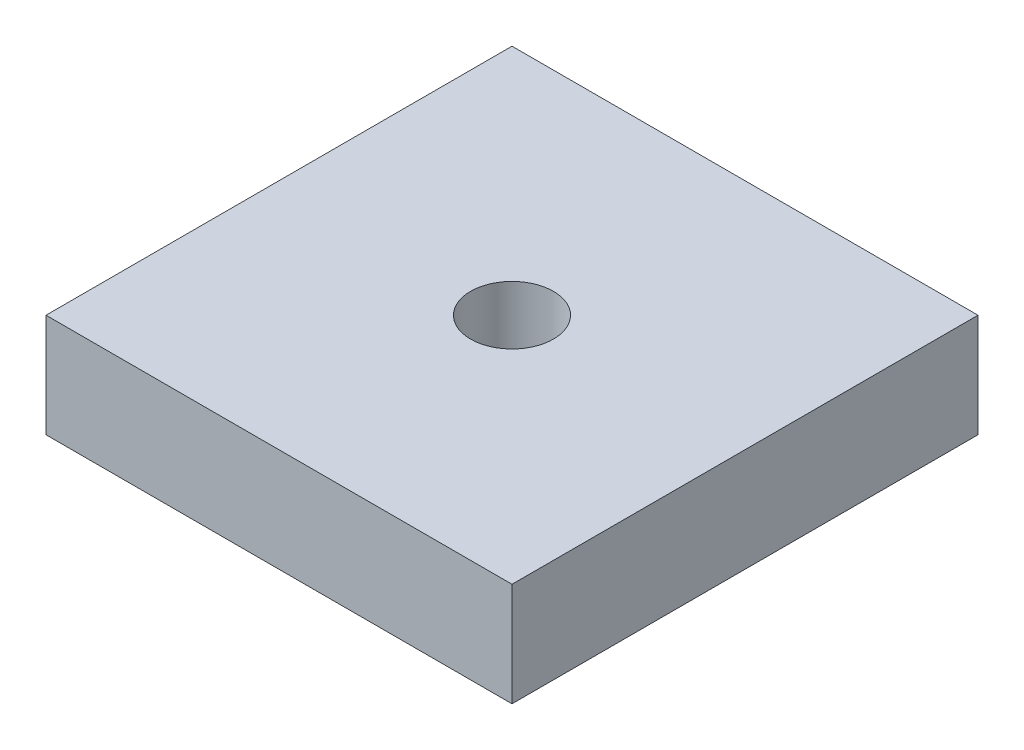
ISO-10303-21;
HEADER;
FILE_DESCRIPTION(('STEP AP214'),'2;1');
FILE_NAME('part.step','',(''),(''),'','','');
FILE_SCHEMA(('AUTOMOTIVE_DESIGN { 1 0 10303 214 1 1 1 1 }'));
ENDSEC;
DATA;
#1=APPLICATION_CONTEXT('core data for automotive mechanical design processes');
#2=APPLICATION_PROTOCOL_DEFINITION('international standard','automotive_design',2000,#1);
#3=PRODUCT_CONTEXT('',#1,'mechanical');
#4=PRODUCT('Part','Part','',(#3));
#5=PRODUCT_RELATED_PRODUCT_CATEGORY('part','',(#4));
#6=PRODUCT_DEFINITION_FORMATION('','',#4);
#7=PRODUCT_DEFINITION_CONTEXT('part definition',#1,'design');
#8=PRODUCT_DEFINITION('design','',#6,#7);
#9=PRODUCT_DEFINITION_SHAPE('','',#8);
#10=(LENGTH_UNIT() NAMED_UNIT(*) SI_UNIT(.MILLI.,.METRE.));
#11=(NAMED_UNIT(*) PLANE_ANGLE_UNIT() SI_UNIT($,.RADIAN.));
#12=(NAMED_UNIT(*) SI_UNIT($,.STERADIAN.) SOLID_ANGLE_UNIT());
#13=UNCERTAINTY_MEASURE_WITH_UNIT(LENGTH_MEASURE(1.E-05),#10,'distance_accuracy_value','');
#14=(GEOMETRIC_REPRESENTATION_CONTEXT(3) GLOBAL_UNCERTAINTY_ASSIGNED_CONTEXT((#13)) GLOBAL_UNIT_ASSIGNED_CONTEXT((#10,
#11,#12)) REPRESENTATION_CONTEXT('',''));
#15=CARTESIAN_POINT('',(0.,0.,0.));
#16=DIRECTION('',(0.,0.,1.));
#17=DIRECTION('',(1.,0.,0.));
#18=AXIS2_PLACEMENT_3D('',#15,#16,#17);
#19=CARTESIAN_POINT('',(-9.,2.,-9.));
#20=DIRECTION('',(1.,0.,0.));
#21=DIRECTION('',(0.,0.,-1.));
#22=AXIS2_PLACEMENT_3D('',#19,#20,#21);
#23=PLANE('',#22);
#24=DIRECTION('',(0.,0.,1.));
#25=VECTOR('',#24,1.);
#26=CARTESIAN_POINT('',(-9.,-2.,-9.));
#27=LINE('',#26,#25);
#28=CARTESIAN_POINT('',(-9.,-2.,-9.));
#29=VERTEX_POINT('',#28);
#30=CARTESIAN_POINT('',(-9.,-2.,9.));
#31=VERTEX_POINT('',#30);
#32=EDGE_CURVE('E79',#29,#31,#27,.T.);
#33=ORIENTED_EDGE('',*,*,#32,.T.);
#34=DIRECTION('',(0.,-1.,0.));
#35=VECTOR('',#34,1.);
#36=CARTESIAN_POINT('',(-9.,2.,9.));
#37=LINE('',#36,#35);
#38=CARTESIAN_POINT('',(-9.,2.,9.));
#39=VERTEX_POINT('',#38);
#40=EDGE_CURVE('E10',#39,#31,#37,.T.);
#41=ORIENTED_EDGE('',*,*,#40,.F.);
#42=DIRECTION('',(0.,0.,1.));
#43=VECTOR('',#42,1.);
#44=CARTESIAN_POINT('',(-9.,2.,-9.));
#45=LINE('',#44,#43);
#46=CARTESIAN_POINT('',(-9.,2.,-9.));
#47=VERTEX_POINT('',#46);
#48=EDGE_CURVE('E67',#47,#39,#45,.T.);
#49=ORIENTED_EDGE('',*,*,#48,.F.);
#50=DIRECTION('',(0.,-1.,0.));
#51=VECTOR('',#50,1.);
#52=CARTESIAN_POINT('',(-9.,2.,-9.));
#53=LINE('',#52,#51);
#54=EDGE_CURVE('E75',#47,#29,#53,.T.);
#55=ORIENTED_EDGE('',*,*,#54,.T.);
#56=EDGE_LOOP('',(#33,#41,#49,#55));
#57=FACE_BOUND('',#56,.T.);
#58=ADVANCED_FACE('F16',(#57),#23,.F.);
#59=CARTESIAN_POINT('',(-9.,2.,9.));
#60=DIRECTION('',(0.,0.,-1.));
#61=DIRECTION('',(-1.,0.,0.));
#62=AXIS2_PLACEMENT_3D('',#59,#60,#61);
#63=PLANE('',#62);
#64=DIRECTION('',(1.,0.,0.));
#65=VECTOR('',#64,1.);
#66=CARTESIAN_POINT('',(-9.,-2.,9.));
#67=LINE('',#66,#65);
#68=CARTESIAN_POINT('',(9.00000000000001,-2.,9.));
#69=VERTEX_POINT('',#68);
#70=EDGE_CURVE('E71',#31,#69,#67,.T.);
#71=ORIENTED_EDGE('',*,*,#70,.T.);
#72=DIRECTION('',(0.,-1.,0.));
#73=VECTOR('',#72,1.);
#74=CARTESIAN_POINT('',(9.00000000000001,2.,9.));
#75=LINE('',#74,#73);
#76=CARTESIAN_POINT('',(9.00000000000001,2.,9.));
#77=VERTEX_POINT('',#76);
#78=EDGE_CURVE('E24',#77,#69,#75,.T.);
#79=ORIENTED_EDGE('',*,*,#78,.F.);
#80=DIRECTION('',(1.,0.,0.));
#81=VECTOR('',#80,1.);
#82=CARTESIAN_POINT('',(-9.,2.,9.));
#83=LINE('',#82,#81);
#84=EDGE_CURVE('E62',#39,#77,#83,.T.);
#85=ORIENTED_EDGE('',*,*,#84,.F.);
#86=ORIENTED_EDGE('',*,*,#40,.T.);
#87=EDGE_LOOP('',(#71,#79,#85,#86));
#88=FACE_BOUND('',#87,.T.);
#89=ADVANCED_FACE('F70',(#88),#63,.F.);
#90=CARTESIAN_POINT('',(9.,2.,-9.));
#91=DIRECTION('',(-1.,0.,0.));
#92=DIRECTION('',(0.,0.,1.));
#93=AXIS2_PLACEMENT_3D('',#90,#91,#92);
#94=PLANE('',#93);
#95=DIRECTION('',(0.,0.,-1.));
#96=VECTOR('',#95,1.);
#97=CARTESIAN_POINT('',(9.,-2.,-9.));
#98=LINE('',#97,#96);
#99=CARTESIAN_POINT('',(9.,-2.,-9.));
#100=VERTEX_POINT('',#99);
#101=EDGE_CURVE('E49',#69,#100,#98,.T.);
#102=ORIENTED_EDGE('',*,*,#101,.T.);
#103=DIRECTION('',(0.,-1.,0.));
#104=VECTOR('',#103,1.);
#105=CARTESIAN_POINT('',(9.,2.,-9.));
#106=LINE('',#105,#104);
#107=CARTESIAN_POINT('',(9.,2.,-9.));
#108=VERTEX_POINT('',#107);
#109=EDGE_CURVE('E72',#108,#100,#106,.T.);
#110=ORIENTED_EDGE('',*,*,#109,.F.);
#111=DIRECTION('',(0.,0.,-1.));
#112=VECTOR('',#111,1.);
#113=CARTESIAN_POINT('',(9.,2.,-9.));
#114=LINE('',#113,#112);
#115=EDGE_CURVE('E65',#77,#108,#114,.T.);
#116=ORIENTED_EDGE('',*,*,#115,.F.);
#117=ORIENTED_EDGE('',*,*,#78,.T.);
#118=EDGE_LOOP('',(#102,#110,#116,#117));
#119=FACE_BOUND('',#118,.T.);
#120=ADVANCED_FACE('F73',(#119),#94,.F.);
#121=CARTESIAN_POINT('',(-9.,2.,-9.));
#122=DIRECTION('',(0.,0.,1.));
#123=DIRECTION('',(1.,0.,0.));
#124=AXIS2_PLACEMENT_3D('',#121,#122,#123);
#125=PLANE('',#124);
#126=DIRECTION('',(-1.,0.,0.));
#127=VECTOR('',#126,1.);
#128=CARTESIAN_POINT('',(-9.,-2.,-9.));
#129=LINE('',#128,#127);
#130=EDGE_CURVE('E55',#100,#29,#129,.T.);
#131=ORIENTED_EDGE('',*,*,#130,.T.);
#132=ORIENTED_EDGE('',*,*,#54,.F.);
#133=DIRECTION('',(-1.,0.,0.));
#134=VECTOR('',#133,1.);
#135=CARTESIAN_POINT('',(-9.,2.,-9.));
#136=LINE('',#135,#134);
#137=EDGE_CURVE('E32',#108,#47,#136,.T.);
#138=ORIENTED_EDGE('',*,*,#137,.F.);
#139=ORIENTED_EDGE('',*,*,#109,.T.);
#140=EDGE_LOOP('',(#131,#132,#138,#139));
#141=FACE_BOUND('',#140,.T.);
#142=ADVANCED_FACE('F87',(#141),#125,.F.);
#143=CARTESIAN_POINT('',(0.,2.,0.));
#144=DIRECTION('',(0.,1.,0.));
#145=DIRECTION('',(0.,0.,1.));
#146=AXIS2_PLACEMENT_3D('',#143,#144,#145);
#147=PLANE('',#146);
#148=CARTESIAN_POINT('',(0.,2.,0.));
#149=DIRECTION('',(0.,1.,0.));
#150=DIRECTION('',(0.,0.,1.));
#151=AXIS2_PLACEMENT_3D('',#148,#149,#150);
#152=CIRCLE('',#151,1.6);
#153=CARTESIAN_POINT('',(0.,2.,1.6));
#154=VERTEX_POINT('',#153);
#155=EDGE_CURVE('E93',#154,#154,#152,.T.);
#156=ORIENTED_EDGE('',*,*,#155,.F.);
#157=EDGE_LOOP('',(#156));
#158=FACE_BOUND('',#157,.T.);
#159=ORIENTED_EDGE('',*,*,#48,.T.);
#160=ORIENTED_EDGE('',*,*,#84,.T.);
#161=ORIENTED_EDGE('',*,*,#115,.T.);
#162=ORIENTED_EDGE('',*,*,#137,.T.);
#163=EDGE_LOOP('',(#159,#160,#161,#162));
#164=FACE_BOUND('',#163,.T.);
#165=ADVANCED_FACE('F63',(#158,#164),#147,.T.);
#166=CARTESIAN_POINT('',(0.,-2.,0.));
#167=DIRECTION('',(0.,1.,0.));
#168=DIRECTION('',(0.,0.,1.));
#169=AXIS2_PLACEMENT_3D('',#166,#167,#168);
#170=PLANE('',#169);
#171=CARTESIAN_POINT('',(0.,-2.,0.));
#172=DIRECTION('',(0.,1.,0.));
#173=DIRECTION('',(0.,0.,1.));
#174=AXIS2_PLACEMENT_3D('',#171,#172,#173);
#175=CIRCLE('',#174,1.6);
#176=CARTESIAN_POINT('',(0.,-2.,1.6));
#177=VERTEX_POINT('',#176);
#178=EDGE_CURVE('E82',#177,#177,#175,.T.);
#179=ORIENTED_EDGE('',*,*,#178,.T.);
#180=EDGE_LOOP('',(#179));
#181=FACE_BOUND('',#180,.T.);
#182=ORIENTED_EDGE('',*,*,#32,.F.);
#183=ORIENTED_EDGE('',*,*,#130,.F.);
#184=ORIENTED_EDGE('',*,*,#101,.F.);
#185=ORIENTED_EDGE('',*,*,#70,.F.);
#186=EDGE_LOOP('',(#182,#183,#184,#185));
#187=FACE_BOUND('',#186,.T.);
#188=ADVANCED_FACE('F90',(#181,#187),#170,.F.);
#189=CARTESIAN_POINT('',(0.,-2.,0.));
#190=DIRECTION('',(0.,1.,0.));
#191=DIRECTION('',(0.,0.,1.));
#192=AXIS2_PLACEMENT_3D('',#189,#190,#191);
#193=CYLINDRICAL_SURFACE('',#192,1.6);
#194=ORIENTED_EDGE('',*,*,#178,.F.);
#195=EDGE_LOOP('',(#194));
#196=FACE_BOUND('',#195,.T.);
#197=ORIENTED_EDGE('',*,*,#155,.T.);
#198=EDGE_LOOP('',(#197));
#199=FACE_BOUND('',#198,.T.);
#200=ADVANCED_FACE('F100',(#196,#199),#193,.F.);
#201=CLOSED_SHELL('',(#58,#89,#120,#142,#165,#188,#200));
#202=MANIFOLD_SOLID_BREP('B1',#201);
#203=ADVANCED_BREP_SHAPE_REPRESENTATION('',(#18,#202),#14);
#204=SHAPE_DEFINITION_REPRESENTATION(#9,#203);
ENDSEC;
END-ISO-10303-21;
